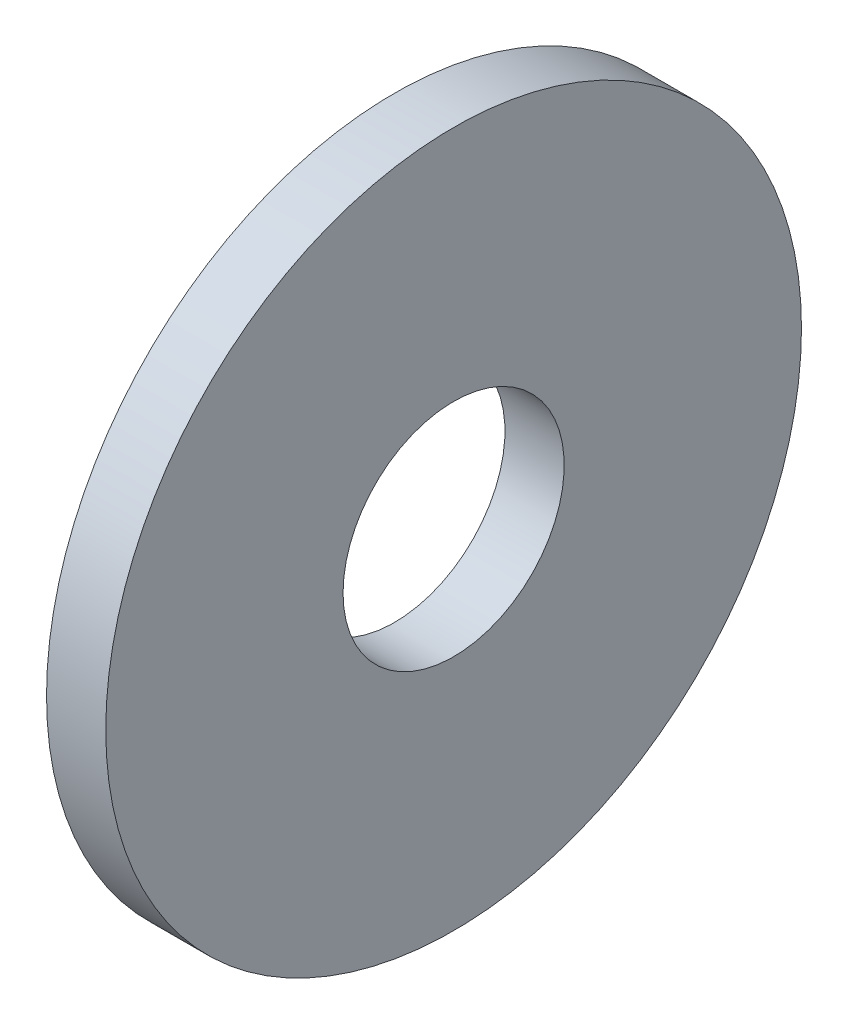
ISO-10303-21;
HEADER;
FILE_DESCRIPTION(('STEP AP214'),'2;1');
FILE_NAME('part.step','',(''),(''),'','','');
FILE_SCHEMA(('AUTOMOTIVE_DESIGN { 1 0 10303 214 1 1 1 1 }'));
ENDSEC;
DATA;
#1=APPLICATION_CONTEXT('core data for automotive mechanical design processes');
#2=APPLICATION_PROTOCOL_DEFINITION('international standard','automotive_design',2000,#1);
#3=PRODUCT_CONTEXT('',#1,'mechanical');
#4=PRODUCT('Part','Part','',(#3));
#5=PRODUCT_RELATED_PRODUCT_CATEGORY('part','',(#4));
#6=PRODUCT_DEFINITION_FORMATION('','',#4);
#7=PRODUCT_DEFINITION_CONTEXT('part definition',#1,'design');
#8=PRODUCT_DEFINITION('design','',#6,#7);
#9=PRODUCT_DEFINITION_SHAPE('','',#8);
#10=(LENGTH_UNIT() NAMED_UNIT(*) SI_UNIT(.MILLI.,.METRE.));
#11=(NAMED_UNIT(*) PLANE_ANGLE_UNIT() SI_UNIT($,.RADIAN.));
#12=(NAMED_UNIT(*) SI_UNIT($,.STERADIAN.) SOLID_ANGLE_UNIT());
#13=UNCERTAINTY_MEASURE_WITH_UNIT(LENGTH_MEASURE(1.E-05),#10,'distance_accuracy_value','');
#14=(GEOMETRIC_REPRESENTATION_CONTEXT(3) GLOBAL_UNCERTAINTY_ASSIGNED_CONTEXT((#13)) GLOBAL_UNIT_ASSIGNED_CONTEXT((#10,
#11,#12)) REPRESENTATION_CONTEXT('',''));
#15=CARTESIAN_POINT('',(0.,0.,0.));
#16=DIRECTION('',(0.,0.,1.));
#17=DIRECTION('',(1.,0.,0.));
#18=AXIS2_PLACEMENT_3D('',#15,#16,#17);
#19=CARTESIAN_POINT('',(13.4089068717294,3.50617287845862,0.));
#20=DIRECTION('',(-1.,0.,0.));
#21=DIRECTION('',(0.,0.,1.));
#22=AXIS2_PLACEMENT_3D('',#19,#20,#21);
#23=PLANE('',#22);
#24=CARTESIAN_POINT('',(13.4089068717294,-2.09382712154138,0.));
#25=DIRECTION('',(-1.,0.,0.));
#26=DIRECTION('',(0.,0.,1.));
#27=AXIS2_PLACEMENT_3D('',#24,#25,#26);
#28=CIRCLE('',#27,17.6173900919517);
#29=CARTESIAN_POINT('',(13.4089068717294,-2.09382712154138,17.6173900919517));
#30=VERTEX_POINT('',#29);
#31=EDGE_CURVE('E10',#30,#30,#28,.T.);
#32=ORIENTED_EDGE('',*,*,#31,.F.);
#33=EDGE_LOOP('',(#32));
#34=FACE_BOUND('',#33,.T.);
#35=CARTESIAN_POINT('',(13.4089068717294,-2.09382712154138,0.));
#36=DIRECTION('',(-1.,0.,0.));
#37=DIRECTION('',(0.,0.,1.));
#38=AXIS2_PLACEMENT_3D('',#35,#36,#37);
#39=CIRCLE('',#38,5.6);
#40=CARTESIAN_POINT('',(13.4089068717294,-2.09382712154138,5.6));
#41=VERTEX_POINT('',#40);
#42=EDGE_CURVE('E56',#41,#41,#39,.T.);
#43=ORIENTED_EDGE('',*,*,#42,.T.);
#44=EDGE_LOOP('',(#43));
#45=FACE_BOUND('',#44,.T.);
#46=ADVANCED_FACE('F39',(#34,#45),#23,.F.);
#47=CARTESIAN_POINT('',(-16.7626873949071,-2.09382712154138,0.));
#48=DIRECTION('',(-1.,0.,0.));
#49=DIRECTION('',(0.,0.,1.));
#50=AXIS2_PLACEMENT_3D('',#47,#48,#49);
#51=CYLINDRICAL_SURFACE('',#50,17.6173900919517);
#52=CARTESIAN_POINT('',(10.4089068717294,-2.09382712154138,0.));
#53=DIRECTION('',(-1.,0.,0.));
#54=DIRECTION('',(0.,0.,1.));
#55=AXIS2_PLACEMENT_3D('',#52,#53,#54);
#56=CIRCLE('',#55,17.6173900919517);
#57=CARTESIAN_POINT('',(10.4089068717294,-2.09382712154138,17.6173900919517));
#58=VERTEX_POINT('',#57);
#59=EDGE_CURVE('E46',#58,#58,#56,.T.);
#60=ORIENTED_EDGE('',*,*,#59,.F.);
#61=EDGE_LOOP('',(#60));
#62=FACE_BOUND('',#61,.T.);
#63=ORIENTED_EDGE('',*,*,#31,.T.);
#64=EDGE_LOOP('',(#63));
#65=FACE_BOUND('',#64,.T.);
#66=ADVANCED_FACE('F72',(#62,#65),#51,.T.);
#67=CARTESIAN_POINT('',(10.4089068717294,3.50617287845862,0.));
#68=DIRECTION('',(1.,0.,0.));
#69=DIRECTION('',(0.,0.,-1.));
#70=AXIS2_PLACEMENT_3D('',#67,#68,#69);
#71=PLANE('',#70);
#72=CARTESIAN_POINT('',(10.4089068717294,-2.09382712154138,0.));
#73=DIRECTION('',(-1.,0.,0.));
#74=DIRECTION('',(0.,0.,1.));
#75=AXIS2_PLACEMENT_3D('',#72,#73,#74);
#76=CIRCLE('',#75,5.6);
#77=CARTESIAN_POINT('',(10.4089068717294,-2.09382712154138,5.6));
#78=VERTEX_POINT('',#77);
#79=EDGE_CURVE('E51',#78,#78,#76,.T.);
#80=ORIENTED_EDGE('',*,*,#79,.F.);
#81=EDGE_LOOP('',(#80));
#82=FACE_BOUND('',#81,.T.);
#83=ORIENTED_EDGE('',*,*,#59,.T.);
#84=EDGE_LOOP('',(#83));
#85=FACE_BOUND('',#84,.T.);
#86=ADVANCED_FACE('F67',(#82,#85),#71,.F.);
#87=CARTESIAN_POINT('',(-16.7626873949071,-2.09382712154138,0.));
#88=DIRECTION('',(-1.,0.,0.));
#89=DIRECTION('',(0.,0.,1.));
#90=AXIS2_PLACEMENT_3D('',#87,#88,#89);
#91=CYLINDRICAL_SURFACE('',#90,5.6);
#92=ORIENTED_EDGE('',*,*,#42,.F.);
#93=EDGE_LOOP('',(#92));
#94=FACE_BOUND('',#93,.T.);
#95=ORIENTED_EDGE('',*,*,#79,.T.);
#96=EDGE_LOOP('',(#95));
#97=FACE_BOUND('',#96,.T.);
#98=ADVANCED_FACE('F64',(#94,#97),#91,.F.);
#99=CLOSED_SHELL('',(#46,#66,#86,#98));
#100=MANIFOLD_SOLID_BREP('B2',#99);
#101=ADVANCED_BREP_SHAPE_REPRESENTATION('',(#18,#100),#14);
#102=SHAPE_DEFINITION_REPRESENTATION(#9,#101);
ENDSEC;
END-ISO-10303-21;
